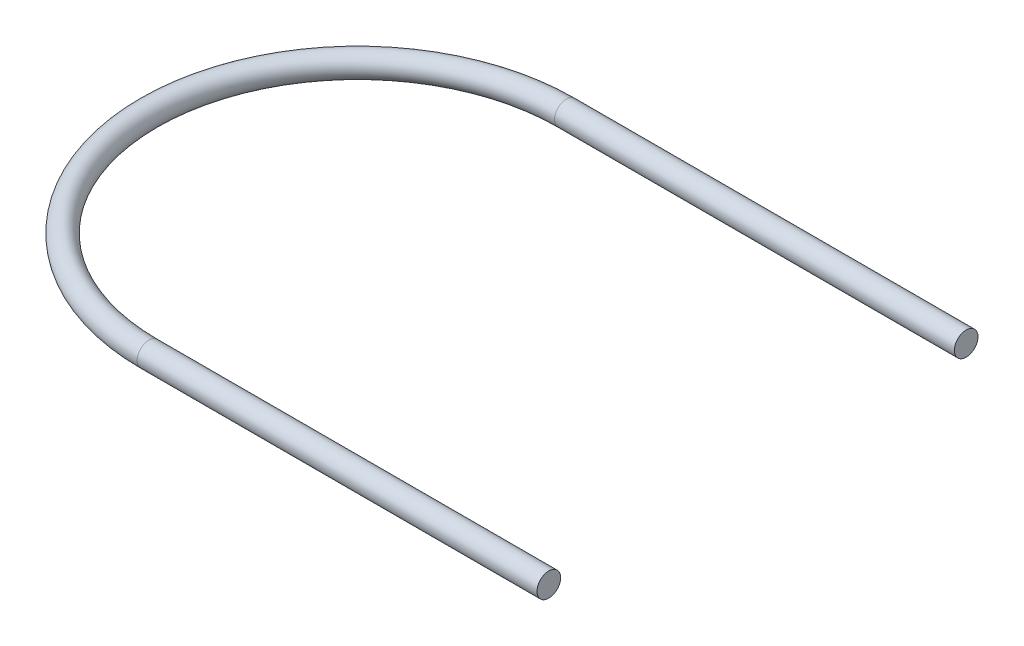
ISO-10303-21;
HEADER;
FILE_DESCRIPTION(('STEP AP214'),'2;1');
FILE_NAME('part.step','',(''),(''),'','','');
FILE_SCHEMA(('AUTOMOTIVE_DESIGN { 1 0 10303 214 1 1 1 1 }'));
ENDSEC;
DATA;
#1=APPLICATION_CONTEXT('core data for automotive mechanical design processes');
#2=APPLICATION_PROTOCOL_DEFINITION('international standard','automotive_design',2000,#1);
#3=PRODUCT_CONTEXT('',#1,'mechanical');
#4=PRODUCT('Part','Part','',(#3));
#5=PRODUCT_RELATED_PRODUCT_CATEGORY('part','',(#4));
#6=PRODUCT_DEFINITION_FORMATION('','',#4);
#7=PRODUCT_DEFINITION_CONTEXT('part definition',#1,'design');
#8=PRODUCT_DEFINITION('design','',#6,#7);
#9=PRODUCT_DEFINITION_SHAPE('','',#8);
#10=(LENGTH_UNIT() NAMED_UNIT(*) SI_UNIT(.MILLI.,.METRE.));
#11=(NAMED_UNIT(*) PLANE_ANGLE_UNIT() SI_UNIT($,.RADIAN.));
#12=(NAMED_UNIT(*) SI_UNIT($,.STERADIAN.) SOLID_ANGLE_UNIT());
#13=UNCERTAINTY_MEASURE_WITH_UNIT(LENGTH_MEASURE(1.E-05),#10,'distance_accuracy_value','');
#14=(GEOMETRIC_REPRESENTATION_CONTEXT(3) GLOBAL_UNCERTAINTY_ASSIGNED_CONTEXT((#13)) GLOBAL_UNIT_ASSIGNED_CONTEXT((#10,
#11,#12)) REPRESENTATION_CONTEXT('',''));
#15=CARTESIAN_POINT('',(0.,0.,0.));
#16=DIRECTION('',(0.,0.,1.));
#17=DIRECTION('',(1.,0.,0.));
#18=AXIS2_PLACEMENT_3D('',#15,#16,#17);
#19=CARTESIAN_POINT('',(0.,0.,-7.85));
#20=DIRECTION('',(1.,0.,0.));
#21=DIRECTION('',(0.,0.,-1.));
#22=AXIS2_PLACEMENT_3D('',#19,#20,#21);
#23=CYLINDRICAL_SURFACE('',#22,0.444500000000001);
#24=CARTESIAN_POINT('',(0.,0.,-7.85));
#25=DIRECTION('',(-1.,0.,0.));
#26=DIRECTION('',(0.,0.,1.));
#27=AXIS2_PLACEMENT_3D('',#24,#25,#26);
#28=CIRCLE('',#27,0.444500000000001);
#29=CARTESIAN_POINT('',(0.,0.,-8.2945));
#30=VERTEX_POINT('',#29);
#31=EDGE_CURVE('E37',#30,#30,#28,.T.);
#32=ORIENTED_EDGE('',*,*,#31,.F.);
#33=EDGE_LOOP('',(#32));
#34=FACE_BOUND('',#33,.T.);
#35=CARTESIAN_POINT('',(15.0408986972934,0.,-7.85));
#36=DIRECTION('',(-1.,0.,0.));
#37=DIRECTION('',(0.,0.,1.));
#38=AXIS2_PLACEMENT_3D('',#35,#36,#37);
#39=CIRCLE('',#38,0.444500000000001);
#40=CARTESIAN_POINT('',(15.0408986972934,0.,-7.4055));
#41=VERTEX_POINT('',#40);
#42=EDGE_CURVE('E10',#41,#41,#39,.T.);
#43=ORIENTED_EDGE('',*,*,#42,.T.);
#44=EDGE_LOOP('',(#43));
#45=FACE_BOUND('',#44,.T.);
#46=ADVANCED_FACE('F31',(#34,#45),#23,.T.);
#47=CARTESIAN_POINT('',(0.,0.,0.));
#48=DIRECTION('',(0.,-1.,0.));
#49=DIRECTION('',(0.,0.,-1.));
#50=AXIS2_PLACEMENT_3D('',#47,#48,#49);
#51=TOROIDAL_SURFACE('',#50,7.85,0.444500000000001);
#52=CARTESIAN_POINT('',(0.,0.,7.85));
#53=DIRECTION('',(1.,0.,0.));
#54=DIRECTION('',(0.,0.,-1.));
#55=AXIS2_PLACEMENT_3D('',#52,#53,#54);
#56=CIRCLE('',#55,0.444500000000001);
#57=CARTESIAN_POINT('',(0.,0.,8.2945));
#58=VERTEX_POINT('',#57);
#59=EDGE_CURVE('E41',#58,#58,#56,.T.);
#60=CARTESIAN_POINT('',(0.,0.,0.));
#61=DIRECTION('',(0.,-1.,0.));
#62=DIRECTION('',(0.,0.,-1.));
#63=AXIS2_PLACEMENT_3D('',#60,#61,#62);
#64=CIRCLE('',#63,8.2945);
#65=EDGE_CURVE('',#58,#30,#64,.T.);
#66=ORIENTED_EDGE('',*,*,#59,.F.);
#67=ORIENTED_EDGE('',*,*,#31,.T.);
#68=ORIENTED_EDGE('',*,*,#65,.T.);
#69=ORIENTED_EDGE('',*,*,#65,.F.);
#70=EDGE_LOOP('',(#66,#68,#67,#69));
#71=FACE_BOUND('',#70,.T.);
#72=ADVANCED_FACE('F56',(#71),#51,.T.);
#73=CARTESIAN_POINT('',(0.,0.,7.85));
#74=DIRECTION('',(1.,0.,0.));
#75=DIRECTION('',(0.,0.,-1.));
#76=AXIS2_PLACEMENT_3D('',#73,#74,#75);
#77=CYLINDRICAL_SURFACE('',#76,0.444500000000001);
#78=ORIENTED_EDGE('',*,*,#59,.T.);
#79=EDGE_LOOP('',(#78));
#80=FACE_BOUND('',#79,.T.);
#81=CARTESIAN_POINT('',(15.0408986972934,0.,7.85));
#82=DIRECTION('',(1.,0.,0.));
#83=DIRECTION('',(0.,0.,-1.));
#84=AXIS2_PLACEMENT_3D('',#81,#82,#83);
#85=CIRCLE('',#84,0.444500000000001);
#86=CARTESIAN_POINT('',(15.0408986972934,0.,7.4055));
#87=VERTEX_POINT('',#86);
#88=EDGE_CURVE('E45',#87,#87,#85,.T.);
#89=ORIENTED_EDGE('',*,*,#88,.F.);
#90=EDGE_LOOP('',(#89));
#91=FACE_BOUND('',#90,.T.);
#92=ADVANCED_FACE('F53',(#80,#91),#77,.T.);
#93=CARTESIAN_POINT('',(15.0408986972934,0.,-7.85));
#94=DIRECTION('',(-1.,0.,0.));
#95=DIRECTION('',(0.,0.,1.));
#96=AXIS2_PLACEMENT_3D('',#93,#94,#95);
#97=PLANE('',#96);
#98=ORIENTED_EDGE('',*,*,#42,.F.);
#99=EDGE_LOOP('',(#98));
#100=FACE_BOUND('',#99,.T.);
#101=ADVANCED_FACE('F55',(#100),#97,.F.);
#102=CARTESIAN_POINT('',(15.0408986972934,0.,7.85));
#103=DIRECTION('',(1.,0.,0.));
#104=DIRECTION('',(0.,0.,-1.));
#105=AXIS2_PLACEMENT_3D('',#102,#103,#104);
#106=PLANE('',#105);
#107=ORIENTED_EDGE('',*,*,#88,.T.);
#108=EDGE_LOOP('',(#107));
#109=FACE_BOUND('',#108,.T.);
#110=ADVANCED_FACE('F51',(#109),#106,.T.);
#111=CLOSED_SHELL('',(#46,#72,#92,#101,#110));
#112=MANIFOLD_SOLID_BREP('B2',#111);
#113=ADVANCED_BREP_SHAPE_REPRESENTATION('',(#18,#112),#14);
#114=SHAPE_DEFINITION_REPRESENTATION(#9,#113);
ENDSEC;
END-ISO-10303-21;
